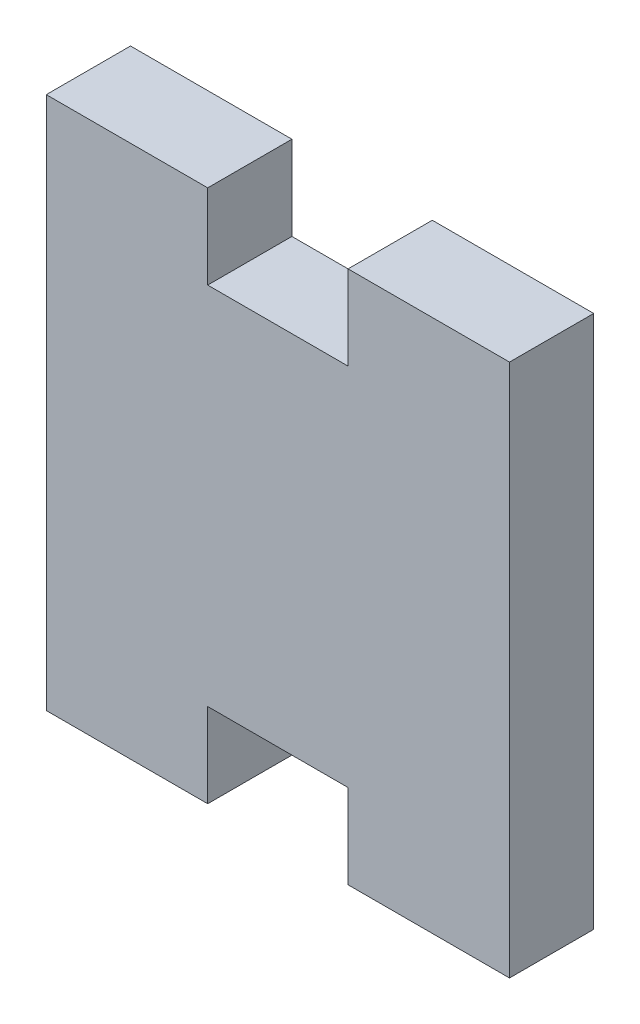
ISO-10303-21;
HEADER;
FILE_DESCRIPTION(('STEP AP214'),'2;1');
FILE_NAME('part.step','',(''),(''),'','','');
FILE_SCHEMA(('AUTOMOTIVE_DESIGN { 1 0 10303 214 1 1 1 1 }'));
ENDSEC;
DATA;
#1=APPLICATION_CONTEXT('core data for automotive mechanical design processes');
#2=APPLICATION_PROTOCOL_DEFINITION('international standard','automotive_design',2000,#1);
#3=PRODUCT_CONTEXT('',#1,'mechanical');
#4=PRODUCT('Part','Part','',(#3));
#5=PRODUCT_RELATED_PRODUCT_CATEGORY('part','',(#4));
#6=PRODUCT_DEFINITION_FORMATION('','',#4);
#7=PRODUCT_DEFINITION_CONTEXT('part definition',#1,'design');
#8=PRODUCT_DEFINITION('design','',#6,#7);
#9=PRODUCT_DEFINITION_SHAPE('','',#8);
#10=(LENGTH_UNIT() NAMED_UNIT(*) SI_UNIT(.MILLI.,.METRE.));
#11=(NAMED_UNIT(*) PLANE_ANGLE_UNIT() SI_UNIT($,.RADIAN.));
#12=(NAMED_UNIT(*) SI_UNIT($,.STERADIAN.) SOLID_ANGLE_UNIT());
#13=UNCERTAINTY_MEASURE_WITH_UNIT(LENGTH_MEASURE(1.E-05),#10,'distance_accuracy_value','');
#14=(GEOMETRIC_REPRESENTATION_CONTEXT(3) GLOBAL_UNCERTAINTY_ASSIGNED_CONTEXT((#13)) GLOBAL_UNIT_ASSIGNED_CONTEXT((#10,
#11,#12)) REPRESENTATION_CONTEXT('',''));
#15=CARTESIAN_POINT('',(0.,0.,0.));
#16=DIRECTION('',(0.,0.,1.));
#17=DIRECTION('',(1.,0.,0.));
#18=AXIS2_PLACEMENT_3D('',#15,#16,#17);
#19=CARTESIAN_POINT('',(-16.5,0.,6.));
#20=DIRECTION('',(-1.,0.,0.));
#21=DIRECTION('',(0.,-1.,0.));
#22=AXIS2_PLACEMENT_3D('',#19,#20,#21);
#23=PLANE('',#22);
#24=DIRECTION('',(0.,1.,0.));
#25=VECTOR('',#24,1.);
#26=CARTESIAN_POINT('',(-16.5,0.,0.));
#27=LINE('',#26,#25);
#28=CARTESIAN_POINT('',(-16.5,-19.,0.));
#29=VERTEX_POINT('',#28);
#30=CARTESIAN_POINT('',(-16.5,19.,0.));
#31=VERTEX_POINT('',#30);
#32=EDGE_CURVE('E154',#29,#31,#27,.T.);
#33=ORIENTED_EDGE('',*,*,#32,.F.);
#34=DIRECTION('',(0.,0.,-1.));
#35=VECTOR('',#34,1.);
#36=CARTESIAN_POINT('',(-16.5,-19.,6.));
#37=LINE('',#36,#35);
#38=CARTESIAN_POINT('',(-16.5,-19.,6.));
#39=VERTEX_POINT('',#38);
#40=EDGE_CURVE('E11',#39,#29,#37,.T.);
#41=ORIENTED_EDGE('',*,*,#40,.F.);
#42=DIRECTION('',(0.,1.,0.));
#43=VECTOR('',#42,1.);
#44=CARTESIAN_POINT('',(-16.5,0.,6.));
#45=LINE('',#44,#43);
#46=CARTESIAN_POINT('',(-16.5,19.,6.));
#47=VERTEX_POINT('',#46);
#48=EDGE_CURVE('E222',#39,#47,#45,.T.);
#49=ORIENTED_EDGE('',*,*,#48,.T.);
#50=DIRECTION('',(0.,0.,-1.));
#51=VECTOR('',#50,1.);
#52=CARTESIAN_POINT('',(-16.5,19.,6.));
#53=LINE('',#52,#51);
#54=EDGE_CURVE('E51',#47,#31,#53,.T.);
#55=ORIENTED_EDGE('',*,*,#54,.T.);
#56=EDGE_LOOP('',(#33,#41,#49,#55));
#57=FACE_BOUND('',#56,.T.);
#58=ADVANCED_FACE('F35',(#57),#23,.T.);
#59=CARTESIAN_POINT('',(0.,-19.,6.));
#60=DIRECTION('',(0.,1.,0.));
#61=DIRECTION('',(-1.,0.,0.));
#62=AXIS2_PLACEMENT_3D('',#59,#60,#61);
#63=PLANE('',#62);
#64=DIRECTION('',(1.,0.,0.));
#65=VECTOR('',#64,1.);
#66=CARTESIAN_POINT('',(0.,-19.,0.));
#67=LINE('',#66,#65);
#68=CARTESIAN_POINT('',(-5.00000000000001,-19.,0.));
#69=VERTEX_POINT('',#68);
#70=EDGE_CURVE('E156',#29,#69,#67,.T.);
#71=ORIENTED_EDGE('',*,*,#70,.T.);
#72=DIRECTION('',(0.,0.,-1.));
#73=VECTOR('',#72,1.);
#74=CARTESIAN_POINT('',(-5.00000000000001,-19.,6.));
#75=LINE('',#74,#73);
#76=CARTESIAN_POINT('',(-5.00000000000001,-19.,6.));
#77=VERTEX_POINT('',#76);
#78=EDGE_CURVE('E43',#77,#69,#75,.T.);
#79=ORIENTED_EDGE('',*,*,#78,.F.);
#80=DIRECTION('',(1.,0.,0.));
#81=VECTOR('',#80,1.);
#82=CARTESIAN_POINT('',(0.,-19.,6.));
#83=LINE('',#82,#81);
#84=EDGE_CURVE('E218',#39,#77,#83,.T.);
#85=ORIENTED_EDGE('',*,*,#84,.F.);
#86=ORIENTED_EDGE('',*,*,#40,.T.);
#87=EDGE_LOOP('',(#71,#79,#85,#86));
#88=FACE_BOUND('',#87,.T.);
#89=ADVANCED_FACE('F206',(#88),#63,.F.);
#90=CARTESIAN_POINT('',(-4.99999999999999,0.,6.));
#91=DIRECTION('',(1.,0.,0.));
#92=DIRECTION('',(0.,1.,0.));
#93=AXIS2_PLACEMENT_3D('',#90,#91,#92);
#94=PLANE('',#93);
#95=DIRECTION('',(0.,-1.,0.));
#96=VECTOR('',#95,1.);
#97=CARTESIAN_POINT('',(-4.99999999999999,0.,0.));
#98=LINE('',#97,#96);
#99=CARTESIAN_POINT('',(-5.,-13.,0.));
#100=VERTEX_POINT('',#99);
#101=EDGE_CURVE('E159',#100,#69,#98,.T.);
#102=ORIENTED_EDGE('',*,*,#101,.F.);
#103=DIRECTION('',(0.,0.,-1.));
#104=VECTOR('',#103,1.);
#105=CARTESIAN_POINT('',(-5.,-13.,6.));
#106=LINE('',#105,#104);
#107=CARTESIAN_POINT('',(-5.,-13.,6.));
#108=VERTEX_POINT('',#107);
#109=EDGE_CURVE('E196',#108,#100,#106,.T.);
#110=ORIENTED_EDGE('',*,*,#109,.F.);
#111=DIRECTION('',(0.,-1.,0.));
#112=VECTOR('',#111,1.);
#113=CARTESIAN_POINT('',(-4.99999999999999,0.,6.));
#114=LINE('',#113,#112);
#115=EDGE_CURVE('E203',#108,#77,#114,.T.);
#116=ORIENTED_EDGE('',*,*,#115,.T.);
#117=ORIENTED_EDGE('',*,*,#78,.T.);
#118=EDGE_LOOP('',(#102,#110,#116,#117));
#119=FACE_BOUND('',#118,.T.);
#120=ADVANCED_FACE('F201',(#119),#94,.T.);
#121=CARTESIAN_POINT('',(0.,-13.,6.));
#122=DIRECTION('',(0.,-1.,0.));
#123=DIRECTION('',(0.,0.,-1.));
#124=AXIS2_PLACEMENT_3D('',#121,#122,#123);
#125=PLANE('',#124);
#126=DIRECTION('',(-1.,0.,0.));
#127=VECTOR('',#126,1.);
#128=CARTESIAN_POINT('',(0.,-13.,0.));
#129=LINE('',#128,#127);
#130=CARTESIAN_POINT('',(5.,-13.,0.));
#131=VERTEX_POINT('',#130);
#132=EDGE_CURVE('E163',#131,#100,#129,.T.);
#133=ORIENTED_EDGE('',*,*,#132,.F.);
#134=DIRECTION('',(0.,0.,-1.));
#135=VECTOR('',#134,1.);
#136=CARTESIAN_POINT('',(5.,-13.,6.));
#137=LINE('',#136,#135);
#138=CARTESIAN_POINT('',(5.,-13.,6.));
#139=VERTEX_POINT('',#138);
#140=EDGE_CURVE('E194',#139,#131,#137,.T.);
#141=ORIENTED_EDGE('',*,*,#140,.F.);
#142=DIRECTION('',(-1.,0.,0.));
#143=VECTOR('',#142,1.);
#144=CARTESIAN_POINT('',(0.,-13.,6.));
#145=LINE('',#144,#143);
#146=EDGE_CURVE('E217',#139,#108,#145,.T.);
#147=ORIENTED_EDGE('',*,*,#146,.T.);
#148=ORIENTED_EDGE('',*,*,#109,.T.);
#149=EDGE_LOOP('',(#133,#141,#147,#148));
#150=FACE_BOUND('',#149,.T.);
#151=ADVANCED_FACE('F213',(#150),#125,.T.);
#152=CARTESIAN_POINT('',(5.,0.,6.));
#153=DIRECTION('',(1.,0.,0.));
#154=DIRECTION('',(0.,0.,-1.));
#155=AXIS2_PLACEMENT_3D('',#152,#153,#154);
#156=PLANE('',#155);
#157=DIRECTION('',(0.,-1.,0.));
#158=VECTOR('',#157,1.);
#159=CARTESIAN_POINT('',(5.,0.,0.));
#160=LINE('',#159,#158);
#161=CARTESIAN_POINT('',(5.,-19.,0.));
#162=VERTEX_POINT('',#161);
#163=EDGE_CURVE('E166',#131,#162,#160,.T.);
#164=ORIENTED_EDGE('',*,*,#163,.T.);
#165=DIRECTION('',(0.,0.,-1.));
#166=VECTOR('',#165,1.);
#167=CARTESIAN_POINT('',(5.,-19.,6.));
#168=LINE('',#167,#166);
#169=CARTESIAN_POINT('',(5.,-19.,6.));
#170=VERTEX_POINT('',#169);
#171=EDGE_CURVE('E191',#170,#162,#168,.T.);
#172=ORIENTED_EDGE('',*,*,#171,.F.);
#173=DIRECTION('',(0.,-1.,0.));
#174=VECTOR('',#173,1.);
#175=CARTESIAN_POINT('',(5.,0.,6.));
#176=LINE('',#175,#174);
#177=EDGE_CURVE('E220',#139,#170,#176,.T.);
#178=ORIENTED_EDGE('',*,*,#177,.F.);
#179=ORIENTED_EDGE('',*,*,#140,.T.);
#180=EDGE_LOOP('',(#164,#172,#178,#179));
#181=FACE_BOUND('',#180,.T.);
#182=ADVANCED_FACE('F261',(#181),#156,.F.);
#183=CARTESIAN_POINT('',(16.5,-19.,0.));
#184=VERTEX_POINT('',#183);
#185=EDGE_CURVE('E160',#162,#184,#67,.T.);
#186=ORIENTED_EDGE('',*,*,#185,.T.);
#187=DIRECTION('',(0.,0.,-1.));
#188=VECTOR('',#187,1.);
#189=CARTESIAN_POINT('',(16.5,-19.,6.));
#190=LINE('',#189,#188);
#191=CARTESIAN_POINT('',(16.5,-19.,6.));
#192=VERTEX_POINT('',#191);
#193=EDGE_CURVE('E188',#192,#184,#190,.T.);
#194=ORIENTED_EDGE('',*,*,#193,.F.);
#195=EDGE_CURVE('E224',#170,#192,#83,.T.);
#196=ORIENTED_EDGE('',*,*,#195,.F.);
#197=ORIENTED_EDGE('',*,*,#171,.T.);
#198=EDGE_LOOP('',(#186,#194,#196,#197));
#199=FACE_BOUND('',#198,.T.);
#200=ADVANCED_FACE('F254',(#199),#63,.F.);
#201=CARTESIAN_POINT('',(16.5,0.,6.));
#202=DIRECTION('',(-1.,0.,0.));
#203=DIRECTION('',(0.,-1.,0.));
#204=AXIS2_PLACEMENT_3D('',#201,#202,#203);
#205=PLANE('',#204);
#206=DIRECTION('',(0.,1.,0.));
#207=VECTOR('',#206,1.);
#208=CARTESIAN_POINT('',(16.5,0.,0.));
#209=LINE('',#208,#207);
#210=CARTESIAN_POINT('',(16.5,19.,0.));
#211=VERTEX_POINT('',#210);
#212=EDGE_CURVE('E168',#184,#211,#209,.T.);
#213=ORIENTED_EDGE('',*,*,#212,.T.);
#214=DIRECTION('',(0.,0.,-1.));
#215=VECTOR('',#214,1.);
#216=CARTESIAN_POINT('',(16.5,19.,6.));
#217=LINE('',#216,#215);
#218=CARTESIAN_POINT('',(16.5,19.,6.));
#219=VERTEX_POINT('',#218);
#220=EDGE_CURVE('E186',#219,#211,#217,.T.);
#221=ORIENTED_EDGE('',*,*,#220,.F.);
#222=DIRECTION('',(0.,1.,0.));
#223=VECTOR('',#222,1.);
#224=CARTESIAN_POINT('',(16.5,0.,6.));
#225=LINE('',#224,#223);
#226=EDGE_CURVE('E228',#192,#219,#225,.T.);
#227=ORIENTED_EDGE('',*,*,#226,.F.);
#228=ORIENTED_EDGE('',*,*,#193,.T.);
#229=EDGE_LOOP('',(#213,#221,#227,#228));
#230=FACE_BOUND('',#229,.T.);
#231=ADVANCED_FACE('F247',(#230),#205,.F.);
#232=CARTESIAN_POINT('',(0.,19.,6.));
#233=DIRECTION('',(0.,1.,0.));
#234=DIRECTION('',(0.,0.,1.));
#235=AXIS2_PLACEMENT_3D('',#232,#233,#234);
#236=PLANE('',#235);
#237=DIRECTION('',(1.,0.,0.));
#238=VECTOR('',#237,1.);
#239=CARTESIAN_POINT('',(0.,19.,0.));
#240=LINE('',#239,#238);
#241=CARTESIAN_POINT('',(5.,19.,0.));
#242=VERTEX_POINT('',#241);
#243=EDGE_CURVE('E171',#242,#211,#240,.T.);
#244=ORIENTED_EDGE('',*,*,#243,.F.);
#245=DIRECTION('',(0.,0.,-1.));
#246=VECTOR('',#245,1.);
#247=CARTESIAN_POINT('',(5.,19.,6.));
#248=LINE('',#247,#246);
#249=CARTESIAN_POINT('',(5.,19.,6.));
#250=VERTEX_POINT('',#249);
#251=EDGE_CURVE('E184',#250,#242,#248,.T.);
#252=ORIENTED_EDGE('',*,*,#251,.F.);
#253=DIRECTION('',(1.,0.,0.));
#254=VECTOR('',#253,1.);
#255=CARTESIAN_POINT('',(0.,19.,6.));
#256=LINE('',#255,#254);
#257=EDGE_CURVE('E151',#250,#219,#256,.T.);
#258=ORIENTED_EDGE('',*,*,#257,.T.);
#259=ORIENTED_EDGE('',*,*,#220,.T.);
#260=EDGE_LOOP('',(#244,#252,#258,#259));
#261=FACE_BOUND('',#260,.T.);
#262=ADVANCED_FACE('F238',(#261),#236,.T.);
#263=CARTESIAN_POINT('',(5.,0.,6.));
#264=DIRECTION('',(-1.,0.,0.));
#265=DIRECTION('',(0.,0.,1.));
#266=AXIS2_PLACEMENT_3D('',#263,#264,#265);
#267=PLANE('',#266);
#268=DIRECTION('',(0.,1.,0.));
#269=VECTOR('',#268,1.);
#270=CARTESIAN_POINT('',(5.,0.,0.));
#271=LINE('',#270,#269);
#272=CARTESIAN_POINT('',(5.,13.,0.));
#273=VERTEX_POINT('',#272);
#274=EDGE_CURVE('E174',#273,#242,#271,.T.);
#275=ORIENTED_EDGE('',*,*,#274,.F.);
#276=DIRECTION('',(0.,0.,-1.));
#277=VECTOR('',#276,1.);
#278=CARTESIAN_POINT('',(5.,13.,6.));
#279=LINE('',#278,#277);
#280=CARTESIAN_POINT('',(5.,13.,6.));
#281=VERTEX_POINT('',#280);
#282=EDGE_CURVE('E145',#281,#273,#279,.T.);
#283=ORIENTED_EDGE('',*,*,#282,.F.);
#284=DIRECTION('',(0.,1.,0.));
#285=VECTOR('',#284,1.);
#286=CARTESIAN_POINT('',(5.,0.,6.));
#287=LINE('',#286,#285);
#288=EDGE_CURVE('E135',#281,#250,#287,.T.);
#289=ORIENTED_EDGE('',*,*,#288,.T.);
#290=ORIENTED_EDGE('',*,*,#251,.T.);
#291=EDGE_LOOP('',(#275,#283,#289,#290));
#292=FACE_BOUND('',#291,.T.);
#293=ADVANCED_FACE('F232',(#292),#267,.T.);
#294=CARTESIAN_POINT('',(0.,13.,6.));
#295=DIRECTION('',(0.,-1.,0.));
#296=DIRECTION('',(0.,0.,-1.));
#297=AXIS2_PLACEMENT_3D('',#294,#295,#296);
#298=PLANE('',#297);
#299=DIRECTION('',(-1.,0.,0.));
#300=VECTOR('',#299,1.);
#301=CARTESIAN_POINT('',(0.,13.,0.));
#302=LINE('',#301,#300);
#303=CARTESIAN_POINT('',(-5.,13.,0.));
#304=VERTEX_POINT('',#303);
#305=EDGE_CURVE('E142',#273,#304,#302,.T.);
#306=ORIENTED_EDGE('',*,*,#305,.T.);
#307=DIRECTION('',(0.,0.,-1.));
#308=VECTOR('',#307,1.);
#309=CARTESIAN_POINT('',(-5.,13.,6.));
#310=LINE('',#309,#308);
#311=CARTESIAN_POINT('',(-5.,13.,6.));
#312=VERTEX_POINT('',#311);
#313=EDGE_CURVE('E139',#312,#304,#310,.T.);
#314=ORIENTED_EDGE('',*,*,#313,.F.);
#315=DIRECTION('',(-1.,0.,0.));
#316=VECTOR('',#315,1.);
#317=CARTESIAN_POINT('',(0.,13.,6.));
#318=LINE('',#317,#316);
#319=EDGE_CURVE('E126',#281,#312,#318,.T.);
#320=ORIENTED_EDGE('',*,*,#319,.F.);
#321=ORIENTED_EDGE('',*,*,#282,.T.);
#322=EDGE_LOOP('',(#306,#314,#320,#321));
#323=FACE_BOUND('',#322,.T.);
#324=ADVANCED_FACE('F140',(#323),#298,.F.);
#325=CARTESIAN_POINT('',(-5.,0.,6.));
#326=DIRECTION('',(-1.,0.,0.));
#327=DIRECTION('',(0.,0.,1.));
#328=AXIS2_PLACEMENT_3D('',#325,#326,#327);
#329=PLANE('',#328);
#330=DIRECTION('',(0.,1.,0.));
#331=VECTOR('',#330,1.);
#332=CARTESIAN_POINT('',(-5.,0.,0.));
#333=LINE('',#332,#331);
#334=CARTESIAN_POINT('',(-5.,19.,0.));
#335=VERTEX_POINT('',#334);
#336=EDGE_CURVE('E179',#304,#335,#333,.T.);
#337=ORIENTED_EDGE('',*,*,#336,.T.);
#338=DIRECTION('',(0.,0.,-1.));
#339=VECTOR('',#338,1.);
#340=CARTESIAN_POINT('',(-5.,19.,6.));
#341=LINE('',#340,#339);
#342=CARTESIAN_POINT('',(-5.,19.,6.));
#343=VERTEX_POINT('',#342);
#344=EDGE_CURVE('E89',#343,#335,#341,.T.);
#345=ORIENTED_EDGE('',*,*,#344,.F.);
#346=DIRECTION('',(0.,1.,0.));
#347=VECTOR('',#346,1.);
#348=CARTESIAN_POINT('',(-5.,0.,6.));
#349=LINE('',#348,#347);
#350=EDGE_CURVE('E132',#312,#343,#349,.T.);
#351=ORIENTED_EDGE('',*,*,#350,.F.);
#352=ORIENTED_EDGE('',*,*,#313,.T.);
#353=EDGE_LOOP('',(#337,#345,#351,#352));
#354=FACE_BOUND('',#353,.T.);
#355=ADVANCED_FACE('F147',(#354),#329,.F.);
#356=EDGE_CURVE('E175',#31,#335,#240,.T.);
#357=ORIENTED_EDGE('',*,*,#356,.F.);
#358=ORIENTED_EDGE('',*,*,#54,.F.);
#359=EDGE_CURVE('E148',#47,#343,#256,.T.);
#360=ORIENTED_EDGE('',*,*,#359,.T.);
#361=ORIENTED_EDGE('',*,*,#344,.T.);
#362=EDGE_LOOP('',(#357,#358,#360,#361));
#363=FACE_BOUND('',#362,.T.);
#364=ADVANCED_FACE('F235',(#363),#236,.T.);
#365=CARTESIAN_POINT('',(0.,0.,6.));
#366=DIRECTION('',(0.,0.,1.));
#367=DIRECTION('',(1.,0.,0.));
#368=AXIS2_PLACEMENT_3D('',#365,#366,#367);
#369=PLANE('',#368);
#370=ORIENTED_EDGE('',*,*,#48,.F.);
#371=ORIENTED_EDGE('',*,*,#84,.T.);
#372=ORIENTED_EDGE('',*,*,#115,.F.);
#373=ORIENTED_EDGE('',*,*,#146,.F.);
#374=ORIENTED_EDGE('',*,*,#177,.T.);
#375=ORIENTED_EDGE('',*,*,#195,.T.);
#376=ORIENTED_EDGE('',*,*,#226,.T.);
#377=ORIENTED_EDGE('',*,*,#257,.F.);
#378=ORIENTED_EDGE('',*,*,#288,.F.);
#379=ORIENTED_EDGE('',*,*,#319,.T.);
#380=ORIENTED_EDGE('',*,*,#350,.T.);
#381=ORIENTED_EDGE('',*,*,#359,.F.);
#382=EDGE_LOOP('',(#370,#371,#372,#373,#374,#375,#376,#377,#378,#379,#380,#381));
#383=FACE_BOUND('',#382,.T.);
#384=ADVANCED_FACE('F129',(#383),#369,.T.);
#385=CARTESIAN_POINT('',(0.,0.,0.));
#386=DIRECTION('',(0.,0.,1.));
#387=DIRECTION('',(1.,0.,0.));
#388=AXIS2_PLACEMENT_3D('',#385,#386,#387);
#389=PLANE('',#388);
#390=ORIENTED_EDGE('',*,*,#32,.T.);
#391=ORIENTED_EDGE('',*,*,#356,.T.);
#392=ORIENTED_EDGE('',*,*,#336,.F.);
#393=ORIENTED_EDGE('',*,*,#305,.F.);
#394=ORIENTED_EDGE('',*,*,#274,.T.);
#395=ORIENTED_EDGE('',*,*,#243,.T.);
#396=ORIENTED_EDGE('',*,*,#212,.F.);
#397=ORIENTED_EDGE('',*,*,#185,.F.);
#398=ORIENTED_EDGE('',*,*,#163,.F.);
#399=ORIENTED_EDGE('',*,*,#132,.T.);
#400=ORIENTED_EDGE('',*,*,#101,.T.);
#401=ORIENTED_EDGE('',*,*,#70,.F.);
#402=EDGE_LOOP('',(#390,#391,#392,#393,#394,#395,#396,#397,#398,#399,#400,#401));
#403=FACE_BOUND('',#402,.T.);
#404=ADVANCED_FACE('F208',(#403),#389,.F.);
#405=CLOSED_SHELL('',(#58,#89,#120,#151,#182,#200,#231,#262,#293,#324,#355,#364,#384,#404));
#406=MANIFOLD_SOLID_BREP('B2',#405);
#407=ADVANCED_BREP_SHAPE_REPRESENTATION('',(#18,#406),#14);
#408=SHAPE_DEFINITION_REPRESENTATION(#9,#407);
ENDSEC;
END-ISO-10303-21;
